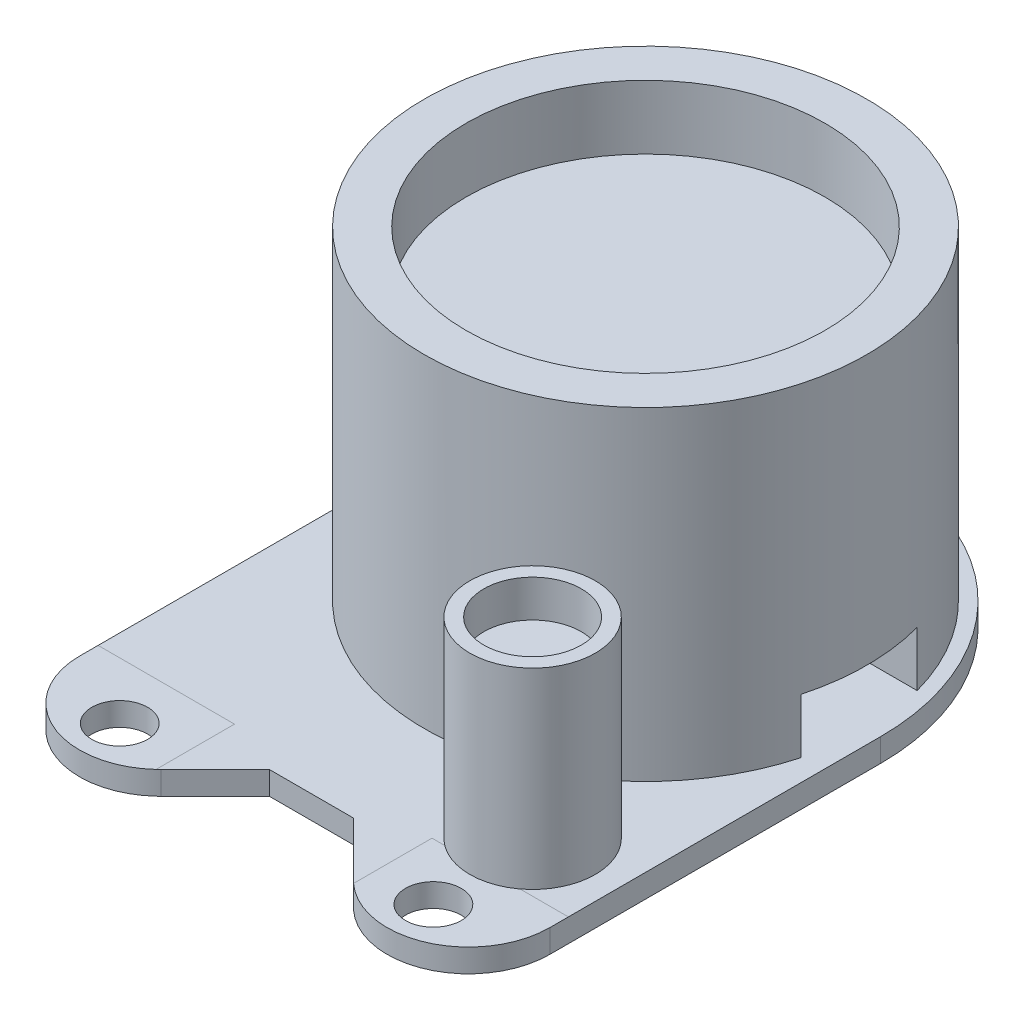
ISO-10303-21;
HEADER;
FILE_DESCRIPTION(('STEP AP214'),'2;1');
FILE_NAME('part.step','',(''),(''),'','','');
FILE_SCHEMA(('AUTOMOTIVE_DESIGN { 1 0 10303 214 1 1 1 1 }'));
ENDSEC;
DATA;
#1=APPLICATION_CONTEXT('core data for automotive mechanical design processes');
#2=APPLICATION_PROTOCOL_DEFINITION('international standard','automotive_design',2000,#1);
#3=PRODUCT_CONTEXT('',#1,'mechanical');
#4=PRODUCT('Part','Part','',(#3));
#5=PRODUCT_RELATED_PRODUCT_CATEGORY('part','',(#4));
#6=PRODUCT_DEFINITION_FORMATION('','',#4);
#7=PRODUCT_DEFINITION_CONTEXT('part definition',#1,'design');
#8=PRODUCT_DEFINITION('design','',#6,#7);
#9=PRODUCT_DEFINITION_SHAPE('','',#8);
#10=(LENGTH_UNIT() NAMED_UNIT(*) SI_UNIT(.MILLI.,.METRE.));
#11=(NAMED_UNIT(*) PLANE_ANGLE_UNIT() SI_UNIT($,.RADIAN.));
#12=(NAMED_UNIT(*) SI_UNIT($,.STERADIAN.) SOLID_ANGLE_UNIT());
#13=UNCERTAINTY_MEASURE_WITH_UNIT(LENGTH_MEASURE(1.E-05),#10,'distance_accuracy_value','');
#14=(GEOMETRIC_REPRESENTATION_CONTEXT(3) GLOBAL_UNCERTAINTY_ASSIGNED_CONTEXT((#13)) GLOBAL_UNIT_ASSIGNED_CONTEXT((#10,
#11,#12)) REPRESENTATION_CONTEXT('',''));
#15=CARTESIAN_POINT('',(0.,0.,0.));
#16=DIRECTION('',(0.,0.,1.));
#17=DIRECTION('',(1.,0.,0.));
#18=AXIS2_PLACEMENT_3D('',#15,#16,#17);
#19=CARTESIAN_POINT('',(6.42,9.25,11.28));
#20=DIRECTION('',(0.,1.,0.));
#21=DIRECTION('',(0.,0.,1.));
#22=AXIS2_PLACEMENT_3D('',#19,#20,#21);
#23=PLANE('',#22);
#24=CARTESIAN_POINT('',(6.42,9.25,11.28));
#25=DIRECTION('',(0.,1.,0.));
#26=DIRECTION('',(0.,0.,1.));
#27=AXIS2_PLACEMENT_3D('',#24,#25,#26);
#28=CIRCLE('',#27,2.7);
#29=CARTESIAN_POINT('',(6.42,9.25,13.98));
#30=VERTEX_POINT('',#29);
#31=EDGE_CURVE('E58',#30,#30,#28,.T.);
#32=ORIENTED_EDGE('',*,*,#31,.T.);
#33=EDGE_LOOP('',(#32));
#34=FACE_BOUND('',#33,.T.);
#35=CARTESIAN_POINT('',(6.42,9.25,11.28));
#36=DIRECTION('',(0.,1.,0.));
#37=DIRECTION('',(1.,0.,0.));
#38=AXIS2_PLACEMENT_3D('',#35,#36,#37);
#39=CIRCLE('',#38,2.1);
#40=CARTESIAN_POINT('',(8.52,9.25,11.28));
#41=VERTEX_POINT('',#40);
#42=EDGE_CURVE('E67',#41,#41,#39,.T.);
#43=ORIENTED_EDGE('',*,*,#42,.F.);
#44=EDGE_LOOP('',(#43));
#45=FACE_BOUND('',#44,.T.);
#46=ADVANCED_FACE('F51',(#34,#45),#23,.T.);
#47=CARTESIAN_POINT('',(6.42,1.,11.28));
#48=DIRECTION('',(0.,1.,0.));
#49=DIRECTION('',(0.,0.,1.));
#50=AXIS2_PLACEMENT_3D('',#47,#48,#49);
#51=PLANE('',#50);
#52=CARTESIAN_POINT('',(6.42,1.,11.28));
#53=DIRECTION('',(0.,1.,0.));
#54=DIRECTION('',(0.,0.,1.));
#55=AXIS2_PLACEMENT_3D('',#52,#53,#54);
#56=CIRCLE('',#55,2.7);
#57=CARTESIAN_POINT('',(6.42,1.,13.98));
#58=VERTEX_POINT('',#57);
#59=EDGE_CURVE('E62',#58,#58,#56,.T.);
#60=ORIENTED_EDGE('',*,*,#59,.F.);
#61=EDGE_LOOP('',(#60));
#62=FACE_BOUND('',#61,.T.);
#63=ADVANCED_FACE('F75',(#62),#51,.F.);
#64=CARTESIAN_POINT('',(6.42,9.25,11.28));
#65=DIRECTION('',(0.,-1.,0.));
#66=DIRECTION('',(0.,0.,-1.));
#67=AXIS2_PLACEMENT_3D('',#64,#65,#66);
#68=CYLINDRICAL_SURFACE('',#67,2.7);
#69=ORIENTED_EDGE('',*,*,#31,.F.);
#70=EDGE_LOOP('',(#69));
#71=FACE_BOUND('',#70,.T.);
#72=ORIENTED_EDGE('',*,*,#59,.T.);
#73=EDGE_LOOP('',(#72));
#74=FACE_BOUND('',#73,.T.);
#75=ADVANCED_FACE('F53',(#71,#74),#68,.T.);
#76=CARTESIAN_POINT('',(6.42,9.25,11.28));
#77=DIRECTION('',(0.,-1.,0.));
#78=DIRECTION('',(0.,0.,-1.));
#79=AXIS2_PLACEMENT_3D('',#76,#77,#78);
#80=CYLINDRICAL_SURFACE('',#79,2.1);
#81=CARTESIAN_POINT('',(6.42,7.65,11.28));
#82=DIRECTION('',(0.,1.,0.));
#83=DIRECTION('',(0.,0.,1.));
#84=AXIS2_PLACEMENT_3D('',#81,#82,#83);
#85=CIRCLE('',#84,2.1);
#86=CARTESIAN_POINT('',(6.42,7.65,13.38));
#87=VERTEX_POINT('',#86);
#88=EDGE_CURVE('E12',#87,#87,#85,.T.);
#89=ORIENTED_EDGE('',*,*,#88,.F.);
#90=EDGE_LOOP('',(#89));
#91=FACE_BOUND('',#90,.T.);
#92=ORIENTED_EDGE('',*,*,#42,.T.);
#93=EDGE_LOOP('',(#92));
#94=FACE_BOUND('',#93,.T.);
#95=ADVANCED_FACE('F72',(#91,#94),#80,.F.);
#96=CARTESIAN_POINT('',(6.42,7.65,11.28));
#97=DIRECTION('',(0.,1.,0.));
#98=DIRECTION('',(0.,0.,1.));
#99=AXIS2_PLACEMENT_3D('',#96,#97,#98);
#100=PLANE('',#99);
#101=ORIENTED_EDGE('',*,*,#88,.T.);
#102=EDGE_LOOP('',(#101));
#103=FACE_BOUND('',#102,.T.);
#104=ADVANCED_FACE('F84',(#103),#100,.T.);
#105=CLOSED_SHELL('',(#46,#63,#75,#95,#104));
#106=MANIFOLD_SOLID_BREP('B2',#105);
#107=CARTESIAN_POINT('',(0.,-18.4895995386643,0.));
#108=DIRECTION('',(0.,1.,0.));
#109=DIRECTION('',(0.,0.,1.));
#110=AXIS2_PLACEMENT_3D('',#107,#108,#109);
#111=CYLINDRICAL_SURFACE('',#110,7.725);
#112=CARTESIAN_POINT('',(0.,3.36,0.));
#113=DIRECTION('',(0.,1.,0.));
#114=DIRECTION('',(0.,0.,1.));
#115=AXIS2_PLACEMENT_3D('',#112,#113,#114);
#116=CIRCLE('',#115,7.725);
#117=CARTESIAN_POINT('',(0.,3.36,7.725));
#118=VERTEX_POINT('',#117);
#119=EDGE_CURVE('E141',#118,#118,#116,.F.);
#120=ORIENTED_EDGE('',*,*,#119,.F.);
#121=EDGE_LOOP('',(#120));
#122=FACE_BOUND('',#121,.T.);
#123=CARTESIAN_POINT('',(0.,12.19,0.));
#124=DIRECTION('',(0.,1.,0.));
#125=DIRECTION('',(0.,0.,1.));
#126=AXIS2_PLACEMENT_3D('',#123,#124,#125);
#127=CIRCLE('',#126,7.725);
#128=CARTESIAN_POINT('',(0.,12.19,7.725));
#129=VERTEX_POINT('',#128);
#130=EDGE_CURVE('E145',#129,#129,#127,.T.);
#131=ORIENTED_EDGE('',*,*,#130,.F.);
#132=EDGE_LOOP('',(#131));
#133=FACE_BOUND('',#132,.T.);
#134=ADVANCED_FACE('F134',(#122,#133),#111,.T.);
#135=CARTESIAN_POINT('',(0.,12.19,0.));
#136=DIRECTION('',(0.,1.,0.));
#137=DIRECTION('',(0.,0.,1.));
#138=AXIS2_PLACEMENT_3D('',#135,#136,#137);
#139=PLANE('',#138);
#140=ORIENTED_EDGE('',*,*,#130,.T.);
#141=EDGE_LOOP('',(#140));
#142=FACE_BOUND('',#141,.T.);
#143=ADVANCED_FACE('F165',(#142),#139,.T.);
#144=CARTESIAN_POINT('',(-10.12,3.36,2.5));
#145=DIRECTION('',(0.,1.,0.));
#146=DIRECTION('',(0.,0.,1.));
#147=AXIS2_PLACEMENT_3D('',#144,#145,#146);
#148=PLANE('',#147);
#149=CARTESIAN_POINT('',(0.,3.36,0.));
#150=DIRECTION('',(0.,1.,0.));
#151=DIRECTION('',(0.,0.,1.));
#152=AXIS2_PLACEMENT_3D('',#149,#150,#151);
#153=CIRCLE('',#152,4.);
#154=CARTESIAN_POINT('',(0.,3.36,4.));
#155=VERTEX_POINT('',#154);
#156=EDGE_CURVE('E150',#155,#155,#153,.T.);
#157=ORIENTED_EDGE('',*,*,#156,.T.);
#158=EDGE_LOOP('',(#157));
#159=FACE_BOUND('',#158,.T.);
#160=ORIENTED_EDGE('',*,*,#119,.T.);
#161=EDGE_LOOP('',(#160));
#162=FACE_BOUND('',#161,.T.);
#163=ADVANCED_FACE('F155',(#159,#162),#148,.F.);
#164=CARTESIAN_POINT('',(0.,7.45,0.));
#165=DIRECTION('',(0.,-1.,0.));
#166=DIRECTION('',(0.,0.,-1.));
#167=AXIS2_PLACEMENT_3D('',#164,#165,#166);
#168=CYLINDRICAL_SURFACE('',#167,4.);
#169=CARTESIAN_POINT('',(0.,3.45,0.));
#170=DIRECTION('',(0.,-1.,0.));
#171=DIRECTION('',(0.,0.,-1.));
#172=AXIS2_PLACEMENT_3D('',#169,#170,#171);
#173=CIRCLE('',#172,4.);
#174=CARTESIAN_POINT('',(0.,3.45,-4.));
#175=VERTEX_POINT('',#174);
#176=EDGE_CURVE('E50',#175,#175,#173,.F.);
#177=ORIENTED_EDGE('',*,*,#176,.T.);
#178=EDGE_LOOP('',(#177));
#179=FACE_BOUND('',#178,.T.);
#180=ORIENTED_EDGE('',*,*,#156,.F.);
#181=EDGE_LOOP('',(#180));
#182=FACE_BOUND('',#181,.T.);
#183=ADVANCED_FACE('F157',(#179,#182),#168,.F.);
#184=CARTESIAN_POINT('',(0.,3.45,0.));
#185=DIRECTION('',(0.,-1.,0.));
#186=DIRECTION('',(0.,0.,-1.));
#187=AXIS2_PLACEMENT_3D('',#184,#185,#186);
#188=SPHERICAL_SURFACE('',#187,4.);
#189=ORIENTED_EDGE('',*,*,#176,.F.);
#190=EDGE_LOOP('',(#189));
#191=FACE_BOUND('',#190,.T.);
#192=ADVANCED_FACE('F136',(#191),#188,.F.);
#193=CLOSED_SHELL('',(#134,#143,#163,#183,#192));
#194=MANIFOLD_SOLID_BREP('B7',#193);
#195=CARTESIAN_POINT('',(0.,1.,0.));
#196=DIRECTION('',(0.,1.,0.));
#197=DIRECTION('',(0.,0.,1.));
#198=AXIS2_PLACEMENT_3D('',#195,#196,#197);
#199=PLANE('',#198);
#200=CARTESIAN_POINT('',(0.,1.,0.));
#201=DIRECTION('',(0.,1.,0.));
#202=DIRECTION('',(0.,0.,1.));
#203=AXIS2_PLACEMENT_3D('',#200,#201,#202);
#204=CIRCLE('',#203,9.525);
#205=CARTESIAN_POINT('',(-9.19106223458421,1.,2.5));
#206=VERTEX_POINT('',#205);
#207=CARTESIAN_POINT('',(9.19106223458421,1.,2.5));
#208=VERTEX_POINT('',#207);
#209=EDGE_CURVE('E298',#206,#208,#204,.T.);
#210=ORIENTED_EDGE('',*,*,#209,.F.);
#211=DIRECTION('',(1.,0.,0.));
#212=VECTOR('',#211,1.);
#213=CARTESIAN_POINT('',(-10.12,1.,2.5));
#214=LINE('',#213,#212);
#215=CARTESIAN_POINT('',(-3.1224989991992,1.,2.5));
#216=VERTEX_POINT('',#215);
#217=EDGE_CURVE('E292',#206,#216,#214,.T.);
#218=ORIENTED_EDGE('',*,*,#217,.T.);
#219=CARTESIAN_POINT('',(0.,1.,0.));
#220=DIRECTION('',(0.,1.,0.));
#221=DIRECTION('',(0.,0.,-1.));
#222=AXIS2_PLACEMENT_3D('',#219,#220,#221);
#223=CIRCLE('',#222,4.);
#224=CARTESIAN_POINT('',(3.1224989991992,1.,2.5));
#225=VERTEX_POINT('',#224);
#226=EDGE_CURVE('E296',#216,#225,#223,.T.);
#227=ORIENTED_EDGE('',*,*,#226,.T.);
#228=EDGE_CURVE('E302',#225,#208,#214,.T.);
#229=ORIENTED_EDGE('',*,*,#228,.T.);
#230=EDGE_LOOP('',(#210,#218,#227,#229));
#231=FACE_BOUND('',#230,.T.);
#232=ADVANCED_FACE('F213',(#231),#199,.F.);
#233=CARTESIAN_POINT('',(0.,14.94,0.));
#234=DIRECTION('',(0.,1.,0.));
#235=DIRECTION('',(0.,0.,1.));
#236=AXIS2_PLACEMENT_3D('',#233,#234,#235);
#237=PLANE('',#236);
#238=CARTESIAN_POINT('',(0.,14.94,0.));
#239=DIRECTION('',(0.,1.,0.));
#240=DIRECTION('',(0.,0.,1.));
#241=AXIS2_PLACEMENT_3D('',#238,#239,#240);
#242=CIRCLE('',#241,9.525);
#243=CARTESIAN_POINT('',(0.,14.94,9.525));
#244=VERTEX_POINT('',#243);
#245=EDGE_CURVE('E372',#244,#244,#242,.T.);
#246=ORIENTED_EDGE('',*,*,#245,.T.);
#247=EDGE_LOOP('',(#246));
#248=FACE_BOUND('',#247,.T.);
#249=CARTESIAN_POINT('',(0.,14.94,0.));
#250=DIRECTION('',(0.,1.,0.));
#251=DIRECTION('',(0.,0.,1.));
#252=AXIS2_PLACEMENT_3D('',#249,#250,#251);
#253=CIRCLE('',#252,7.725);
#254=CARTESIAN_POINT('',(0.,14.94,7.725));
#255=VERTEX_POINT('',#254);
#256=EDGE_CURVE('E369',#255,#255,#253,.T.);
#257=ORIENTED_EDGE('',*,*,#256,.F.);
#258=EDGE_LOOP('',(#257));
#259=FACE_BOUND('',#258,.T.);
#260=ADVANCED_FACE('F417',(#248,#259),#237,.T.);
#261=CARTESIAN_POINT('',(9.19106223458421,1.,-2.5));
#262=VERTEX_POINT('',#261);
#263=CARTESIAN_POINT('',(-9.19106223458421,1.,-2.5));
#264=VERTEX_POINT('',#263);
#265=EDGE_CURVE('E374',#262,#264,#204,.T.);
#266=ORIENTED_EDGE('',*,*,#265,.F.);
#267=DIRECTION('',(1.,0.,0.));
#268=VECTOR('',#267,1.);
#269=CARTESIAN_POINT('',(-10.12,1.,-2.5));
#270=LINE('',#269,#268);
#271=CARTESIAN_POINT('',(3.1224989991992,1.,-2.5));
#272=VERTEX_POINT('',#271);
#273=EDGE_CURVE('E301',#272,#262,#270,.T.);
#274=ORIENTED_EDGE('',*,*,#273,.F.);
#275=CARTESIAN_POINT('',(0.,1.,0.));
#276=DIRECTION('',(0.,1.,0.));
#277=DIRECTION('',(0.,0.,-1.));
#278=AXIS2_PLACEMENT_3D('',#275,#276,#277);
#279=CIRCLE('',#278,4.);
#280=CARTESIAN_POINT('',(-3.1224989991992,1.,-2.5));
#281=VERTEX_POINT('',#280);
#282=EDGE_CURVE('E326',#272,#281,#279,.T.);
#283=ORIENTED_EDGE('',*,*,#282,.T.);
#284=EDGE_CURVE('E353',#264,#281,#270,.T.);
#285=ORIENTED_EDGE('',*,*,#284,.F.);
#286=EDGE_LOOP('',(#266,#274,#283,#285));
#287=FACE_BOUND('',#286,.T.);
#288=ADVANCED_FACE('F380',(#287),#199,.F.);
#289=CARTESIAN_POINT('',(0.,14.94,0.));
#290=DIRECTION('',(0.,-1.,0.));
#291=DIRECTION('',(0.,0.,-1.));
#292=AXIS2_PLACEMENT_3D('',#289,#290,#291);
#293=CYLINDRICAL_SURFACE('',#292,9.525);
#294=ORIENTED_EDGE('',*,*,#245,.F.);
#295=EDGE_LOOP('',(#294));
#296=FACE_BOUND('',#295,.T.);
#297=ORIENTED_EDGE('',*,*,#209,.T.);
#298=DIRECTION('',(0.,-1.,0.));
#299=VECTOR('',#298,1.);
#300=CARTESIAN_POINT('',(9.1910622345842,14.94,2.50000000000001));
#301=LINE('',#300,#299);
#302=CARTESIAN_POINT('',(9.19106223458421,3.36,2.5));
#303=VERTEX_POINT('',#302);
#304=EDGE_CURVE('E364',#208,#303,#301,.F.);
#305=ORIENTED_EDGE('',*,*,#304,.T.);
#306=CARTESIAN_POINT('',(0.,3.36,0.));
#307=DIRECTION('',(0.,1.,0.));
#308=DIRECTION('',(0.,0.,1.));
#309=AXIS2_PLACEMENT_3D('',#306,#307,#308);
#310=CIRCLE('',#309,9.525);
#311=CARTESIAN_POINT('',(9.19106223458421,3.36,-2.5));
#312=VERTEX_POINT('',#311);
#313=EDGE_CURVE('E228',#303,#312,#310,.T.);
#314=ORIENTED_EDGE('',*,*,#313,.T.);
#315=DIRECTION('',(0.,-1.,0.));
#316=VECTOR('',#315,1.);
#317=CARTESIAN_POINT('',(9.1910622345842,14.94,-2.50000000000001));
#318=LINE('',#317,#316);
#319=EDGE_CURVE('E358',#312,#262,#318,.T.);
#320=ORIENTED_EDGE('',*,*,#319,.T.);
#321=ORIENTED_EDGE('',*,*,#265,.T.);
#322=DIRECTION('',(0.,-1.,0.));
#323=VECTOR('',#322,1.);
#324=CARTESIAN_POINT('',(-9.1910622345842,14.94,-2.50000000000001));
#325=LINE('',#324,#323);
#326=CARTESIAN_POINT('',(-9.1910622345842,3.36,-2.5));
#327=VERTEX_POINT('',#326);
#328=EDGE_CURVE('E355',#264,#327,#325,.F.);
#329=ORIENTED_EDGE('',*,*,#328,.T.);
#330=CARTESIAN_POINT('',(-9.19106223458421,3.36,2.5));
#331=VERTEX_POINT('',#330);
#332=EDGE_CURVE('E361',#327,#331,#310,.T.);
#333=ORIENTED_EDGE('',*,*,#332,.T.);
#334=DIRECTION('',(0.,-1.,0.));
#335=VECTOR('',#334,1.);
#336=CARTESIAN_POINT('',(-9.1910622345842,14.94,2.50000000000001));
#337=LINE('',#336,#335);
#338=EDGE_CURVE('E367',#331,#206,#337,.T.);
#339=ORIENTED_EDGE('',*,*,#338,.T.);
#340=EDGE_LOOP('',(#297,#305,#314,#320,#321,#329,#333,#339));
#341=FACE_BOUND('',#340,.T.);
#342=ADVANCED_FACE('F215',(#296,#341),#293,.T.);
#343=CARTESIAN_POINT('',(0.,14.94,0.));
#344=DIRECTION('',(0.,-1.,0.));
#345=DIRECTION('',(0.,0.,-1.));
#346=AXIS2_PLACEMENT_3D('',#343,#344,#345);
#347=CYLINDRICAL_SURFACE('',#346,7.725);
#348=CARTESIAN_POINT('',(0.,3.36,0.));
#349=DIRECTION('',(0.,1.,0.));
#350=DIRECTION('',(0.,0.,1.));
#351=AXIS2_PLACEMENT_3D('',#348,#349,#350);
#352=CIRCLE('',#351,7.725);
#353=CARTESIAN_POINT('',(7.30928348061559,3.36,2.5));
#354=VERTEX_POINT('',#353);
#355=CARTESIAN_POINT('',(-7.3092834806156,3.36,2.5));
#356=VERTEX_POINT('',#355);
#357=EDGE_CURVE('E318',#354,#356,#352,.F.);
#358=ORIENTED_EDGE('',*,*,#357,.T.);
#359=CARTESIAN_POINT('',(0.,3.36,0.));
#360=DIRECTION('',(0.,1.,0.));
#361=DIRECTION('',(0.,0.,1.));
#362=AXIS2_PLACEMENT_3D('',#359,#360,#361);
#363=CIRCLE('',#362,7.725);
#364=CARTESIAN_POINT('',(-7.3092834806156,3.36,-2.5));
#365=VERTEX_POINT('',#364);
#366=EDGE_CURVE('E217',#365,#356,#363,.T.);
#367=ORIENTED_EDGE('',*,*,#366,.F.);
#368=CARTESIAN_POINT('',(0.,3.36,0.));
#369=DIRECTION('',(0.,1.,0.));
#370=DIRECTION('',(0.,0.,1.));
#371=AXIS2_PLACEMENT_3D('',#368,#369,#370);
#372=CIRCLE('',#371,7.725);
#373=CARTESIAN_POINT('',(7.30928348061559,3.36,-2.5));
#374=VERTEX_POINT('',#373);
#375=EDGE_CURVE('E333',#365,#374,#372,.F.);
#376=ORIENTED_EDGE('',*,*,#375,.T.);
#377=EDGE_CURVE('E132',#354,#374,#363,.T.);
#378=ORIENTED_EDGE('',*,*,#377,.F.);
#379=EDGE_LOOP('',(#358,#367,#376,#378));
#380=FACE_BOUND('',#379,.T.);
#381=ORIENTED_EDGE('',*,*,#256,.T.);
#382=EDGE_LOOP('',(#381));
#383=FACE_BOUND('',#382,.T.);
#384=ADVANCED_FACE('F398',(#380,#383),#347,.F.);
#385=CARTESIAN_POINT('',(-10.12,1.,-2.5));
#386=DIRECTION('',(0.,0.,-1.));
#387=DIRECTION('',(0.,1.,0.));
#388=AXIS2_PLACEMENT_3D('',#385,#386,#387);
#389=PLANE('',#388);
#390=ORIENTED_EDGE('',*,*,#284,.T.);
#391=DIRECTION('',(0.,-1.,0.));
#392=VECTOR('',#391,1.);
#393=CARTESIAN_POINT('',(-3.1224989991992,18.8842753454066,-2.5));
#394=LINE('',#393,#392);
#395=CARTESIAN_POINT('',(-3.1224989991992,3.36,-2.5));
#396=VERTEX_POINT('',#395);
#397=EDGE_CURVE('E339',#396,#281,#394,.T.);
#398=ORIENTED_EDGE('',*,*,#397,.F.);
#399=DIRECTION('',(-1.,0.,0.));
#400=VECTOR('',#399,1.);
#401=CARTESIAN_POINT('',(-7.3092834806156,3.36,-2.5));
#402=LINE('',#401,#400);
#403=EDGE_CURVE('E336',#396,#365,#402,.T.);
#404=ORIENTED_EDGE('',*,*,#403,.T.);
#405=DIRECTION('',(1.,0.,0.));
#406=VECTOR('',#405,1.);
#407=CARTESIAN_POINT('',(-10.12,3.36,-2.5));
#408=LINE('',#407,#406);
#409=EDGE_CURVE('E350',#327,#365,#408,.T.);
#410=ORIENTED_EDGE('',*,*,#409,.F.);
#411=ORIENTED_EDGE('',*,*,#328,.F.);
#412=EDGE_LOOP('',(#390,#398,#404,#410,#411));
#413=FACE_BOUND('',#412,.T.);
#414=ADVANCED_FACE('F384',(#413),#389,.F.);
#415=CARTESIAN_POINT('',(-10.12,3.36,2.5));
#416=DIRECTION('',(0.,1.,0.));
#417=DIRECTION('',(0.,0.,1.));
#418=AXIS2_PLACEMENT_3D('',#415,#416,#417);
#419=PLANE('',#418);
#420=ORIENTED_EDGE('',*,*,#409,.T.);
#421=ORIENTED_EDGE('',*,*,#366,.T.);
#422=DIRECTION('',(1.,0.,0.));
#423=VECTOR('',#422,1.);
#424=CARTESIAN_POINT('',(-10.12,3.36,2.5));
#425=LINE('',#424,#423);
#426=EDGE_CURVE('E349',#331,#356,#425,.T.);
#427=ORIENTED_EDGE('',*,*,#426,.F.);
#428=ORIENTED_EDGE('',*,*,#332,.F.);
#429=EDGE_LOOP('',(#420,#421,#427,#428));
#430=FACE_BOUND('',#429,.T.);
#431=ADVANCED_FACE('F395',(#430),#419,.F.);
#432=CARTESIAN_POINT('',(-10.12,1.,2.5));
#433=DIRECTION('',(0.,0.,1.));
#434=DIRECTION('',(0.,-1.,0.));
#435=AXIS2_PLACEMENT_3D('',#432,#433,#434);
#436=PLANE('',#435);
#437=ORIENTED_EDGE('',*,*,#426,.T.);
#438=DIRECTION('',(1.,0.,0.));
#439=VECTOR('',#438,1.);
#440=CARTESIAN_POINT('',(-7.3092834806156,3.36,2.5));
#441=LINE('',#440,#439);
#442=CARTESIAN_POINT('',(-3.1224989991992,3.36,2.5));
#443=VERTEX_POINT('',#442);
#444=EDGE_CURVE('E309',#356,#443,#441,.T.);
#445=ORIENTED_EDGE('',*,*,#444,.T.);
#446=DIRECTION('',(0.,-1.,0.));
#447=VECTOR('',#446,1.);
#448=CARTESIAN_POINT('',(-3.1224989991992,18.8842753454066,2.5));
#449=LINE('',#448,#447);
#450=EDGE_CURVE('E306',#443,#216,#449,.T.);
#451=ORIENTED_EDGE('',*,*,#450,.T.);
#452=ORIENTED_EDGE('',*,*,#217,.F.);
#453=ORIENTED_EDGE('',*,*,#338,.F.);
#454=EDGE_LOOP('',(#437,#445,#451,#452,#453));
#455=FACE_BOUND('',#454,.T.);
#456=ADVANCED_FACE('F308',(#455),#436,.F.);
#457=ORIENTED_EDGE('',*,*,#228,.F.);
#458=DIRECTION('',(0.,-1.,0.));
#459=VECTOR('',#458,1.);
#460=CARTESIAN_POINT('',(3.1224989991992,18.8842753454066,2.5));
#461=LINE('',#460,#459);
#462=CARTESIAN_POINT('',(3.1224989991992,3.36,2.5));
#463=VERTEX_POINT('',#462);
#464=EDGE_CURVE('E316',#463,#225,#461,.T.);
#465=ORIENTED_EDGE('',*,*,#464,.F.);
#466=DIRECTION('',(1.,0.,0.));
#467=VECTOR('',#466,1.);
#468=CARTESIAN_POINT('',(3.1224989991992,3.36,2.5));
#469=LINE('',#468,#467);
#470=EDGE_CURVE('E235',#463,#354,#469,.T.);
#471=ORIENTED_EDGE('',*,*,#470,.T.);
#472=EDGE_CURVE('E347',#354,#303,#425,.T.);
#473=ORIENTED_EDGE('',*,*,#472,.T.);
#474=ORIENTED_EDGE('',*,*,#304,.F.);
#475=EDGE_LOOP('',(#457,#465,#471,#473,#474));
#476=FACE_BOUND('',#475,.T.);
#477=ADVANCED_FACE('F405',(#476),#436,.F.);
#478=ORIENTED_EDGE('',*,*,#472,.F.);
#479=ORIENTED_EDGE('',*,*,#377,.T.);
#480=EDGE_CURVE('E351',#374,#312,#408,.T.);
#481=ORIENTED_EDGE('',*,*,#480,.T.);
#482=ORIENTED_EDGE('',*,*,#313,.F.);
#483=EDGE_LOOP('',(#478,#479,#481,#482));
#484=FACE_BOUND('',#483,.T.);
#485=ADVANCED_FACE('F404',(#484),#419,.F.);
#486=ORIENTED_EDGE('',*,*,#480,.F.);
#487=DIRECTION('',(-1.,0.,0.));
#488=VECTOR('',#487,1.);
#489=CARTESIAN_POINT('',(3.1224989991992,3.36,-2.5));
#490=LINE('',#489,#488);
#491=CARTESIAN_POINT('',(3.1224989991992,3.36,-2.5));
#492=VERTEX_POINT('',#491);
#493=EDGE_CURVE('E329',#374,#492,#490,.T.);
#494=ORIENTED_EDGE('',*,*,#493,.T.);
#495=DIRECTION('',(0.,-1.,0.));
#496=VECTOR('',#495,1.);
#497=CARTESIAN_POINT('',(3.1224989991992,18.8842753454066,-2.5));
#498=LINE('',#497,#496);
#499=EDGE_CURVE('E332',#492,#272,#498,.T.);
#500=ORIENTED_EDGE('',*,*,#499,.T.);
#501=ORIENTED_EDGE('',*,*,#273,.T.);
#502=ORIENTED_EDGE('',*,*,#319,.F.);
#503=EDGE_LOOP('',(#486,#494,#500,#501,#502));
#504=FACE_BOUND('',#503,.T.);
#505=ADVANCED_FACE('F412',(#504),#389,.F.);
#506=CARTESIAN_POINT('',(-10.12,3.36,2.5));
#507=DIRECTION('',(0.,1.,0.));
#508=DIRECTION('',(0.,0.,1.));
#509=AXIS2_PLACEMENT_3D('',#506,#507,#508);
#510=PLANE('',#509);
#511=ORIENTED_EDGE('',*,*,#375,.F.);
#512=ORIENTED_EDGE('',*,*,#403,.F.);
#513=CARTESIAN_POINT('',(0.,3.36,0.));
#514=DIRECTION('',(0.,1.,0.));
#515=DIRECTION('',(0.,0.,1.));
#516=AXIS2_PLACEMENT_3D('',#513,#514,#515);
#517=CIRCLE('',#516,4.);
#518=EDGE_CURVE('E340',#492,#396,#517,.T.);
#519=ORIENTED_EDGE('',*,*,#518,.F.);
#520=ORIENTED_EDGE('',*,*,#493,.F.);
#521=EDGE_LOOP('',(#511,#512,#519,#520));
#522=FACE_BOUND('',#521,.T.);
#523=ADVANCED_FACE('F390',(#522),#510,.T.);
#524=CARTESIAN_POINT('',(0.,18.8842753454066,0.));
#525=DIRECTION('',(0.,-1.,0.));
#526=DIRECTION('',(0.,0.,-1.));
#527=AXIS2_PLACEMENT_3D('',#524,#525,#526);
#528=CYLINDRICAL_SURFACE('',#527,4.);
#529=ORIENTED_EDGE('',*,*,#499,.F.);
#530=ORIENTED_EDGE('',*,*,#518,.T.);
#531=ORIENTED_EDGE('',*,*,#397,.T.);
#532=ORIENTED_EDGE('',*,*,#282,.F.);
#533=EDGE_LOOP('',(#529,#530,#531,#532));
#534=FACE_BOUND('',#533,.T.);
#535=ADVANCED_FACE('F388',(#534),#528,.F.);
#536=CARTESIAN_POINT('',(-10.12,3.36,2.5));
#537=DIRECTION('',(0.,1.,0.));
#538=DIRECTION('',(0.,0.,1.));
#539=AXIS2_PLACEMENT_3D('',#536,#537,#538);
#540=PLANE('',#539);
#541=CARTESIAN_POINT('',(0.,3.36,0.));
#542=DIRECTION('',(0.,1.,0.));
#543=DIRECTION('',(0.,0.,1.));
#544=AXIS2_PLACEMENT_3D('',#541,#542,#543);
#545=CIRCLE('',#544,4.);
#546=EDGE_CURVE('E312',#443,#463,#545,.T.);
#547=ORIENTED_EDGE('',*,*,#546,.F.);
#548=ORIENTED_EDGE('',*,*,#444,.F.);
#549=ORIENTED_EDGE('',*,*,#357,.F.);
#550=ORIENTED_EDGE('',*,*,#470,.F.);
#551=EDGE_LOOP('',(#547,#548,#549,#550));
#552=FACE_BOUND('',#551,.T.);
#553=ADVANCED_FACE('F403',(#552),#540,.T.);
#554=CARTESIAN_POINT('',(0.,18.8842753454066,0.));
#555=DIRECTION('',(0.,-1.,0.));
#556=DIRECTION('',(0.,0.,-1.));
#557=AXIS2_PLACEMENT_3D('',#554,#555,#556);
#558=CYLINDRICAL_SURFACE('',#557,4.);
#559=ORIENTED_EDGE('',*,*,#450,.F.);
#560=ORIENTED_EDGE('',*,*,#546,.T.);
#561=ORIENTED_EDGE('',*,*,#464,.T.);
#562=ORIENTED_EDGE('',*,*,#226,.F.);
#563=EDGE_LOOP('',(#559,#560,#561,#562));
#564=FACE_BOUND('',#563,.T.);
#565=ADVANCED_FACE('F315',(#564),#558,.F.);
#566=CLOSED_SHELL('',(#232,#260,#288,#342,#384,#414,#431,#456,#477,#485,#505,#523,#535,#553,#565));
#567=MANIFOLD_SOLID_BREP('B45',#566);
#568=CARTESIAN_POINT('',(0.,0.,0.));
#569=DIRECTION('',(0.,1.,0.));
#570=DIRECTION('',(0.,0.,1.));
#571=AXIS2_PLACEMENT_3D('',#568,#569,#570);
#572=PLANE('',#571);
#573=CARTESIAN_POINT('',(0.,0.,0.));
#574=DIRECTION('',(0.,1.,0.));
#575=DIRECTION('',(0.,0.,1.));
#576=AXIS2_PLACEMENT_3D('',#573,#574,#575);
#577=CIRCLE('',#576,4.25);
#578=CARTESIAN_POINT('',(0.,0.,4.25));
#579=VERTEX_POINT('',#578);
#580=EDGE_CURVE('E703',#579,#579,#577,.F.);
#581=ORIENTED_EDGE('',*,*,#580,.T.);
#582=EDGE_LOOP('',(#581));
#583=FACE_BOUND('',#582,.T.);
#584=CARTESIAN_POINT('',(3.75,0.,0.));
#585=DIRECTION('',(0.,1.,0.));
#586=DIRECTION('',(0.,0.,1.));
#587=AXIS2_PLACEMENT_3D('',#584,#585,#586);
#588=CIRCLE('',#587,0.15);
#589=CARTESIAN_POINT('',(3.75,0.,0.15));
#590=VERTEX_POINT('',#589);
#591=EDGE_CURVE('E709',#590,#590,#588,.F.);
#592=ORIENTED_EDGE('',*,*,#591,.F.);
#593=EDGE_LOOP('',(#592));
#594=FACE_BOUND('',#593,.T.);
#595=CARTESIAN_POINT('',(2.65165042944955,0.,-2.65165042944955));
#596=DIRECTION('',(0.,1.,0.));
#597=DIRECTION('',(0.,0.,1.));
#598=AXIS2_PLACEMENT_3D('',#595,#596,#597);
#599=CIRCLE('',#598,0.15);
#600=CARTESIAN_POINT('',(2.65165042944955,0.,-2.50165042944955));
#601=VERTEX_POINT('',#600);
#602=EDGE_CURVE('E713',#601,#601,#599,.F.);
#603=ORIENTED_EDGE('',*,*,#602,.F.);
#604=EDGE_LOOP('',(#603));
#605=FACE_BOUND('',#604,.T.);
#606=CARTESIAN_POINT('',(0.,0.,-3.75));
#607=DIRECTION('',(0.,1.,0.));
#608=DIRECTION('',(0.,0.,1.));
#609=AXIS2_PLACEMENT_3D('',#606,#607,#608);
#610=CIRCLE('',#609,0.15);
#611=CARTESIAN_POINT('',(0.,0.,-3.6));
#612=VERTEX_POINT('',#611);
#613=EDGE_CURVE('E717',#612,#612,#610,.F.);
#614=ORIENTED_EDGE('',*,*,#613,.F.);
#615=EDGE_LOOP('',(#614));
#616=FACE_BOUND('',#615,.T.);
#617=CARTESIAN_POINT('',(-2.65165042944956,0.,-2.65165042944954));
#618=DIRECTION('',(0.,1.,0.));
#619=DIRECTION('',(0.,0.,1.));
#620=AXIS2_PLACEMENT_3D('',#617,#618,#619);
#621=CIRCLE('',#620,0.15);
#622=CARTESIAN_POINT('',(-2.65165042944956,0.,-2.50165042944954));
#623=VERTEX_POINT('',#622);
#624=EDGE_CURVE('E721',#623,#623,#621,.F.);
#625=ORIENTED_EDGE('',*,*,#624,.F.);
#626=EDGE_LOOP('',(#625));
#627=FACE_BOUND('',#626,.T.);
#628=CARTESIAN_POINT('',(-3.75,0.,0.));
#629=DIRECTION('',(0.,1.,0.));
#630=DIRECTION('',(0.,0.,1.));
#631=AXIS2_PLACEMENT_3D('',#628,#629,#630);
#632=CIRCLE('',#631,0.15);
#633=CARTESIAN_POINT('',(-3.75,0.,0.150000000000021));
#634=VERTEX_POINT('',#633);
#635=EDGE_CURVE('E725',#634,#634,#632,.F.);
#636=ORIENTED_EDGE('',*,*,#635,.F.);
#637=EDGE_LOOP('',(#636));
#638=FACE_BOUND('',#637,.T.);
#639=CARTESIAN_POINT('',(-2.65165042944953,0.,2.65165042944957));
#640=DIRECTION('',(0.,1.,0.));
#641=DIRECTION('',(0.,0.,1.));
#642=AXIS2_PLACEMENT_3D('',#639,#640,#641);
#643=CIRCLE('',#642,0.15);
#644=CARTESIAN_POINT('',(-2.65165042944953,0.,2.80165042944957));
#645=VERTEX_POINT('',#644);
#646=EDGE_CURVE('E729',#645,#645,#643,.F.);
#647=ORIENTED_EDGE('',*,*,#646,.F.);
#648=EDGE_LOOP('',(#647));
#649=FACE_BOUND('',#648,.T.);
#650=CARTESIAN_POINT('',(0.,0.,3.75));
#651=DIRECTION('',(0.,1.,0.));
#652=DIRECTION('',(0.,0.,1.));
#653=AXIS2_PLACEMENT_3D('',#650,#651,#652);
#654=CIRCLE('',#653,0.15);
#655=CARTESIAN_POINT('',(0.,0.,3.9));
#656=VERTEX_POINT('',#655);
#657=EDGE_CURVE('E557',#656,#656,#654,.F.);
#658=ORIENTED_EDGE('',*,*,#657,.F.);
#659=EDGE_LOOP('',(#658));
#660=FACE_BOUND('',#659,.T.);
#661=CARTESIAN_POINT('',(2.65165042944958,0.,2.65165042944952));
#662=DIRECTION('',(0.,1.,0.));
#663=DIRECTION('',(0.,0.,1.));
#664=AXIS2_PLACEMENT_3D('',#661,#662,#663);
#665=CIRCLE('',#664,0.15);
#666=CARTESIAN_POINT('',(2.65165042944958,0.,2.80165042944952));
#667=VERTEX_POINT('',#666);
#668=EDGE_CURVE('E211',#667,#667,#665,.F.);
#669=ORIENTED_EDGE('',*,*,#668,.F.);
#670=EDGE_LOOP('',(#669));
#671=FACE_BOUND('',#670,.T.);
#672=ADVANCED_FACE('F548',(#583,#594,#605,#616,#627,#638,#649,#660,#671),#572,.F.);
#673=ORIENTED_EDGE('',*,*,#668,.T.);
#674=EDGE_LOOP('',(#673));
#675=FACE_BOUND('',#674,.T.);
#676=ADVANCED_FACE('F744',(#675),#572,.F.);
#677=ORIENTED_EDGE('',*,*,#657,.T.);
#678=EDGE_LOOP('',(#677));
#679=FACE_BOUND('',#678,.T.);
#680=ADVANCED_FACE('F740',(#679),#572,.F.);
#681=ORIENTED_EDGE('',*,*,#646,.T.);
#682=EDGE_LOOP('',(#681));
#683=FACE_BOUND('',#682,.T.);
#684=ADVANCED_FACE('F754',(#683),#572,.F.);
#685=ORIENTED_EDGE('',*,*,#635,.T.);
#686=EDGE_LOOP('',(#685));
#687=FACE_BOUND('',#686,.T.);
#688=ADVANCED_FACE('F858',(#687),#572,.F.);
#689=ORIENTED_EDGE('',*,*,#624,.T.);
#690=EDGE_LOOP('',(#689));
#691=FACE_BOUND('',#690,.T.);
#692=ADVANCED_FACE('F851',(#691),#572,.F.);
#693=ORIENTED_EDGE('',*,*,#613,.T.);
#694=EDGE_LOOP('',(#693));
#695=FACE_BOUND('',#694,.T.);
#696=ADVANCED_FACE('F844',(#695),#572,.F.);
#697=ORIENTED_EDGE('',*,*,#602,.T.);
#698=EDGE_LOOP('',(#697));
#699=FACE_BOUND('',#698,.T.);
#700=ADVANCED_FACE('F838',(#699),#572,.F.);
#701=DIRECTION('',(0.,0.,1.));
#702=VECTOR('',#701,1.);
#703=CARTESIAN_POINT('',(-4.25,0.,0.));
#704=LINE('',#703,#702);
#705=CARTESIAN_POINT('',(-4.25,0.,13.44));
#706=VERTEX_POINT('',#705);
#707=CARTESIAN_POINT('',(-4.25,0.,16.8154805376861));
#708=VERTEX_POINT('',#707);
#709=EDGE_CURVE('E564',#706,#708,#704,.T.);
#710=ORIENTED_EDGE('',*,*,#709,.F.);
#711=DIRECTION('',(1.,0.,0.));
#712=VECTOR('',#711,1.);
#713=CARTESIAN_POINT('',(0.,0.,13.44));
#714=LINE('',#713,#712);
#715=CARTESIAN_POINT('',(-10.12,0.,13.44));
#716=VERTEX_POINT('',#715);
#717=EDGE_CURVE('E568',#716,#706,#714,.T.);
#718=ORIENTED_EDGE('',*,*,#717,.F.);
#719=DIRECTION('',(0.,0.,1.));
#720=VECTOR('',#719,1.);
#721=CARTESIAN_POINT('',(-10.12,0.,0.));
#722=LINE('',#721,#720);
#723=CARTESIAN_POINT('',(-10.12,0.,0.));
#724=VERTEX_POINT('',#723);
#725=EDGE_CURVE('E1012',#724,#716,#722,.T.);
#726=ORIENTED_EDGE('',*,*,#725,.F.);
#727=CARTESIAN_POINT('',(0.,0.,0.));
#728=DIRECTION('',(0.,1.,0.));
#729=DIRECTION('',(0.,0.,1.));
#730=AXIS2_PLACEMENT_3D('',#727,#728,#729);
#731=CIRCLE('',#730,10.12);
#732=CARTESIAN_POINT('',(10.12,0.,0.));
#733=VERTEX_POINT('',#732);
#734=EDGE_CURVE('E673',#733,#724,#731,.T.);
#735=ORIENTED_EDGE('',*,*,#734,.F.);
#736=DIRECTION('',(0.,0.,-1.));
#737=VECTOR('',#736,1.);
#738=CARTESIAN_POINT('',(10.12,0.,0.));
#739=LINE('',#738,#737);
#740=CARTESIAN_POINT('',(10.12,0.,13.44));
#741=VERTEX_POINT('',#740);
#742=EDGE_CURVE('E1028',#741,#733,#739,.T.);
#743=ORIENTED_EDGE('',*,*,#742,.F.);
#744=DIRECTION('',(1.,0.,0.));
#745=VECTOR('',#744,1.);
#746=CARTESIAN_POINT('',(0.,0.,13.44));
#747=LINE('',#746,#745);
#748=CARTESIAN_POINT('',(4.25,0.,13.44));
#749=VERTEX_POINT('',#748);
#750=EDGE_CURVE('E689',#749,#741,#747,.T.);
#751=ORIENTED_EDGE('',*,*,#750,.F.);
#752=DIRECTION('',(0.,0.,-1.));
#753=VECTOR('',#752,1.);
#754=CARTESIAN_POINT('',(4.25,0.,0.));
#755=LINE('',#754,#753);
#756=CARTESIAN_POINT('',(4.25,0.,16.8154805376861));
#757=VERTEX_POINT('',#756);
#758=EDGE_CURVE('E688',#757,#749,#755,.T.);
#759=ORIENTED_EDGE('',*,*,#758,.F.);
#760=CARTESIAN_POINT('',(6.62,0.,14.24));
#761=DIRECTION('',(0.,1.,0.));
#762=DIRECTION('',(0.,0.,1.));
#763=AXIS2_PLACEMENT_3D('',#760,#761,#762);
#764=CIRCLE('',#763,3.5);
#765=CARTESIAN_POINT('',(4.14512626584709,0.,16.7148737341529));
#766=VERTEX_POINT('',#765);
#767=EDGE_CURVE('E1025',#766,#757,#764,.T.);
#768=ORIENTED_EDGE('',*,*,#767,.F.);
#769=DIRECTION('',(0.707106781186549,0.,0.707106781186546));
#770=VECTOR('',#769,1.);
#771=CARTESIAN_POINT('',(1.81025253169416,0.,14.38));
#772=LINE('',#771,#770);
#773=CARTESIAN_POINT('',(1.81025253169416,0.,14.38));
#774=VERTEX_POINT('',#773);
#775=EDGE_CURVE('E1022',#774,#766,#772,.T.);
#776=ORIENTED_EDGE('',*,*,#775,.F.);
#777=DIRECTION('',(1.,0.,0.));
#778=VECTOR('',#777,1.);
#779=CARTESIAN_POINT('',(-1.81025253169415,0.,14.38));
#780=LINE('',#779,#778);
#781=CARTESIAN_POINT('',(-1.81025253169415,0.,14.38));
#782=VERTEX_POINT('',#781);
#783=EDGE_CURVE('E1020',#782,#774,#780,.T.);
#784=ORIENTED_EDGE('',*,*,#783,.F.);
#785=DIRECTION('',(0.70710678118655,0.,-0.707106781186545));
#786=VECTOR('',#785,1.);
#787=CARTESIAN_POINT('',(-4.14512626584709,0.,16.7148737341529));
#788=LINE('',#787,#786);
#789=CARTESIAN_POINT('',(-4.14512626584709,0.,16.7148737341529));
#790=VERTEX_POINT('',#789);
#791=EDGE_CURVE('E1018',#790,#782,#788,.T.);
#792=ORIENTED_EDGE('',*,*,#791,.F.);
#793=CARTESIAN_POINT('',(-6.62,0.,14.24));
#794=DIRECTION('',(0.,1.,0.));
#795=DIRECTION('',(0.,0.,-1.));
#796=AXIS2_PLACEMENT_3D('',#793,#794,#795);
#797=CIRCLE('',#796,3.5);
#798=EDGE_CURVE('E1014',#708,#790,#797,.T.);
#799=ORIENTED_EDGE('',*,*,#798,.F.);
#800=EDGE_LOOP('',(#710,#718,#726,#735,#743,#751,#759,#768,#776,#784,#792,#799));
#801=FACE_BOUND('',#800,.T.);
#802=ORIENTED_EDGE('',*,*,#580,.F.);
#803=EDGE_LOOP('',(#802));
#804=FACE_BOUND('',#803,.T.);
#805=ADVANCED_FACE('F831',(#801,#804),#572,.F.);
#806=ORIENTED_EDGE('',*,*,#591,.T.);
#807=EDGE_LOOP('',(#806));
#808=FACE_BOUND('',#807,.T.);
#809=ADVANCED_FACE('F819',(#808),#572,.F.);
#810=CARTESIAN_POINT('',(0.,1.,0.));
#811=DIRECTION('',(0.,1.,0.));
#812=DIRECTION('',(0.,0.,1.));
#813=AXIS2_PLACEMENT_3D('',#810,#811,#812);
#814=PLANE('',#813);
#815=DIRECTION('',(1.,0.,0.));
#816=VECTOR('',#815,1.);
#817=CARTESIAN_POINT('',(0.,1.,13.44));
#818=LINE('',#817,#816);
#819=CARTESIAN_POINT('',(-10.12,1.,13.44));
#820=VERTEX_POINT('',#819);
#821=CARTESIAN_POINT('',(-4.25,1.,13.44));
#822=VERTEX_POINT('',#821);
#823=EDGE_CURVE('E692',#820,#822,#818,.T.);
#824=ORIENTED_EDGE('',*,*,#823,.T.);
#825=DIRECTION('',(0.,0.,1.));
#826=VECTOR('',#825,1.);
#827=CARTESIAN_POINT('',(-4.25,1.,0.));
#828=LINE('',#827,#826);
#829=CARTESIAN_POINT('',(-4.25,1.,16.8154805376861));
#830=VERTEX_POINT('',#829);
#831=EDGE_CURVE('E698',#822,#830,#828,.T.);
#832=ORIENTED_EDGE('',*,*,#831,.T.);
#833=CARTESIAN_POINT('',(-6.62,1.,14.24));
#834=DIRECTION('',(0.,1.,0.));
#835=DIRECTION('',(0.,0.,-1.));
#836=AXIS2_PLACEMENT_3D('',#833,#834,#835);
#837=CIRCLE('',#836,3.5);
#838=CARTESIAN_POINT('',(-4.14512626584709,1.,16.7148737341529));
#839=VERTEX_POINT('',#838);
#840=EDGE_CURVE('E660',#830,#839,#837,.T.);
#841=ORIENTED_EDGE('',*,*,#840,.T.);
#842=DIRECTION('',(0.70710678118655,0.,-0.707106781186545));
#843=VECTOR('',#842,1.);
#844=CARTESIAN_POINT('',(-4.14512626584709,1.,16.7148737341529));
#845=LINE('',#844,#843);
#846=CARTESIAN_POINT('',(-1.81025253169415,1.,14.38));
#847=VERTEX_POINT('',#846);
#848=EDGE_CURVE('E996',#839,#847,#845,.T.);
#849=ORIENTED_EDGE('',*,*,#848,.T.);
#850=DIRECTION('',(1.,0.,0.));
#851=VECTOR('',#850,1.);
#852=CARTESIAN_POINT('',(-1.81025253169415,1.,14.38));
#853=LINE('',#852,#851);
#854=CARTESIAN_POINT('',(1.81025253169416,1.,14.38));
#855=VERTEX_POINT('',#854);
#856=EDGE_CURVE('E998',#847,#855,#853,.T.);
#857=ORIENTED_EDGE('',*,*,#856,.T.);
#858=DIRECTION('',(0.707106781186549,0.,0.707106781186546));
#859=VECTOR('',#858,1.);
#860=CARTESIAN_POINT('',(1.81025253169416,1.,14.38));
#861=LINE('',#860,#859);
#862=CARTESIAN_POINT('',(4.14512626584709,1.,16.7148737341529));
#863=VERTEX_POINT('',#862);
#864=EDGE_CURVE('E1000',#855,#863,#861,.T.);
#865=ORIENTED_EDGE('',*,*,#864,.T.);
#866=CARTESIAN_POINT('',(6.62,1.,14.24));
#867=DIRECTION('',(0.,1.,0.));
#868=DIRECTION('',(0.,0.,1.));
#869=AXIS2_PLACEMENT_3D('',#866,#867,#868);
#870=CIRCLE('',#869,3.5);
#871=CARTESIAN_POINT('',(4.25,1.,16.8154805376861));
#872=VERTEX_POINT('',#871);
#873=EDGE_CURVE('E1003',#863,#872,#870,.T.);
#874=ORIENTED_EDGE('',*,*,#873,.T.);
#875=DIRECTION('',(0.,0.,-1.));
#876=VECTOR('',#875,1.);
#877=CARTESIAN_POINT('',(4.25,1.,0.));
#878=LINE('',#877,#876);
#879=CARTESIAN_POINT('',(4.25,1.,13.44));
#880=VERTEX_POINT('',#879);
#881=EDGE_CURVE('E674',#872,#880,#878,.T.);
#882=ORIENTED_EDGE('',*,*,#881,.T.);
#883=DIRECTION('',(1.,0.,0.));
#884=VECTOR('',#883,1.);
#885=CARTESIAN_POINT('',(0.,1.,13.44));
#886=LINE('',#885,#884);
#887=CARTESIAN_POINT('',(10.12,1.,13.44));
#888=VERTEX_POINT('',#887);
#889=EDGE_CURVE('E679',#880,#888,#886,.T.);
#890=ORIENTED_EDGE('',*,*,#889,.T.);
#891=DIRECTION('',(0.,0.,-1.));
#892=VECTOR('',#891,1.);
#893=CARTESIAN_POINT('',(10.12,1.,0.));
#894=LINE('',#893,#892);
#895=CARTESIAN_POINT('',(10.12,1.,0.));
#896=VERTEX_POINT('',#895);
#897=EDGE_CURVE('E666',#888,#896,#894,.T.);
#898=ORIENTED_EDGE('',*,*,#897,.T.);
#899=CARTESIAN_POINT('',(0.,1.,0.));
#900=DIRECTION('',(0.,1.,0.));
#901=DIRECTION('',(0.,0.,1.));
#902=AXIS2_PLACEMENT_3D('',#899,#900,#901);
#903=CIRCLE('',#902,10.12);
#904=CARTESIAN_POINT('',(-10.12,1.,0.));
#905=VERTEX_POINT('',#904);
#906=EDGE_CURVE('E663',#896,#905,#903,.T.);
#907=ORIENTED_EDGE('',*,*,#906,.T.);
#908=DIRECTION('',(0.,0.,1.));
#909=VECTOR('',#908,1.);
#910=CARTESIAN_POINT('',(-10.12,1.,0.));
#911=LINE('',#910,#909);
#912=EDGE_CURVE('E649',#905,#820,#911,.T.);
#913=ORIENTED_EDGE('',*,*,#912,.T.);
#914=EDGE_LOOP('',(#824,#832,#841,#849,#857,#865,#874,#882,#890,#898,#907,#913));
#915=FACE_BOUND('',#914,.T.);
#916=ADVANCED_FACE('F664',(#915),#814,.T.);
#917=CARTESIAN_POINT('',(-6.75,0.,15.88));
#918=DIRECTION('',(0.,1.,0.));
#919=DIRECTION('',(0.,0.,1.));
#920=AXIS2_PLACEMENT_3D('',#917,#918,#919);
#921=CIRCLE('',#920,1.2);
#922=CARTESIAN_POINT('',(-6.75,0.,17.08));
#923=VERTEX_POINT('',#922);
#924=EDGE_CURVE('E984',#923,#923,#921,.T.);
#925=ORIENTED_EDGE('',*,*,#924,.T.);
#926=EDGE_LOOP('',(#925));
#927=FACE_BOUND('',#926,.T.);
#928=ORIENTED_EDGE('',*,*,#717,.T.);
#929=ORIENTED_EDGE('',*,*,#709,.T.);
#930=CARTESIAN_POINT('',(-10.12,0.,14.24));
#931=VERTEX_POINT('',#930);
#932=EDGE_CURVE('E1015',#931,#708,#797,.T.);
#933=ORIENTED_EDGE('',*,*,#932,.F.);
#934=EDGE_CURVE('E1011',#716,#931,#722,.T.);
#935=ORIENTED_EDGE('',*,*,#934,.F.);
#936=EDGE_LOOP('',(#928,#929,#933,#935));
#937=FACE_BOUND('',#936,.T.);
#938=ADVANCED_FACE('F760',(#927,#937),#572,.F.);
#939=ORIENTED_EDGE('',*,*,#831,.F.);
#940=ORIENTED_EDGE('',*,*,#823,.F.);
#941=CARTESIAN_POINT('',(-10.12,1.,14.24));
#942=VERTEX_POINT('',#941);
#943=EDGE_CURVE('E657',#820,#942,#911,.T.);
#944=ORIENTED_EDGE('',*,*,#943,.T.);
#945=EDGE_CURVE('E993',#942,#830,#837,.T.);
#946=ORIENTED_EDGE('',*,*,#945,.T.);
#947=EDGE_LOOP('',(#939,#940,#944,#946));
#948=FACE_BOUND('',#947,.T.);
#949=CARTESIAN_POINT('',(-6.75,1.,15.88));
#950=DIRECTION('',(0.,1.,0.));
#951=DIRECTION('',(0.,0.,1.));
#952=AXIS2_PLACEMENT_3D('',#949,#950,#951);
#953=CIRCLE('',#952,1.2);
#954=CARTESIAN_POINT('',(-6.75,1.,17.08));
#955=VERTEX_POINT('',#954);
#956=EDGE_CURVE('E981',#955,#955,#953,.T.);
#957=ORIENTED_EDGE('',*,*,#956,.F.);
#958=EDGE_LOOP('',(#957));
#959=FACE_BOUND('',#958,.T.);
#960=ADVANCED_FACE('F804',(#948,#959),#814,.T.);
#961=ORIENTED_EDGE('',*,*,#889,.F.);
#962=ORIENTED_EDGE('',*,*,#881,.F.);
#963=CARTESIAN_POINT('',(10.12,1.,14.24));
#964=VERTEX_POINT('',#963);
#965=EDGE_CURVE('E1002',#872,#964,#870,.T.);
#966=ORIENTED_EDGE('',*,*,#965,.T.);
#967=EDGE_CURVE('E1006',#964,#888,#894,.T.);
#968=ORIENTED_EDGE('',*,*,#967,.T.);
#969=EDGE_LOOP('',(#961,#962,#966,#968));
#970=FACE_BOUND('',#969,.T.);
#971=CARTESIAN_POINT('',(6.75,1.,15.88));
#972=DIRECTION('',(0.,1.,0.));
#973=DIRECTION('',(0.,0.,-1.));
#974=AXIS2_PLACEMENT_3D('',#971,#972,#973);
#975=CIRCLE('',#974,1.2);
#976=CARTESIAN_POINT('',(6.75,1.,14.68));
#977=VERTEX_POINT('',#976);
#978=EDGE_CURVE('E985',#977,#977,#975,.T.);
#979=ORIENTED_EDGE('',*,*,#978,.F.);
#980=EDGE_LOOP('',(#979));
#981=FACE_BOUND('',#980,.T.);
#982=ADVANCED_FACE('F758',(#970,#981),#814,.T.);
#983=ORIENTED_EDGE('',*,*,#758,.T.);
#984=ORIENTED_EDGE('',*,*,#750,.T.);
#985=CARTESIAN_POINT('',(10.12,0.,14.24));
#986=VERTEX_POINT('',#985);
#987=EDGE_CURVE('E670',#986,#741,#739,.T.);
#988=ORIENTED_EDGE('',*,*,#987,.F.);
#989=EDGE_CURVE('E1024',#757,#986,#764,.T.);
#990=ORIENTED_EDGE('',*,*,#989,.F.);
#991=EDGE_LOOP('',(#983,#984,#988,#990));
#992=FACE_BOUND('',#991,.T.);
#993=CARTESIAN_POINT('',(6.75,0.,15.88));
#994=DIRECTION('',(0.,1.,0.));
#995=DIRECTION('',(0.,0.,-1.));
#996=AXIS2_PLACEMENT_3D('',#993,#994,#995);
#997=CIRCLE('',#996,1.2);
#998=CARTESIAN_POINT('',(6.75,0.,14.68));
#999=VERTEX_POINT('',#998);
#1000=EDGE_CURVE('E989',#999,#999,#997,.T.);
#1001=ORIENTED_EDGE('',*,*,#1000,.T.);
#1002=EDGE_LOOP('',(#1001));
#1003=FACE_BOUND('',#1002,.T.);
#1004=ADVANCED_FACE('F747',(#992,#1003),#572,.F.);
#1005=CARTESIAN_POINT('',(0.,1.,0.));
#1006=DIRECTION('',(0.,-1.,0.));
#1007=DIRECTION('',(0.,0.,-1.));
#1008=AXIS2_PLACEMENT_3D('',#1005,#1006,#1007);
#1009=CYLINDRICAL_SURFACE('',#1008,10.12);
#1010=ORIENTED_EDGE('',*,*,#734,.T.);
#1011=DIRECTION('',(0.,-1.,0.));
#1012=VECTOR('',#1011,1.);
#1013=CARTESIAN_POINT('',(-10.12,1.,0.));
#1014=LINE('',#1013,#1012);
#1015=EDGE_CURVE('E654',#905,#724,#1014,.T.);
#1016=ORIENTED_EDGE('',*,*,#1015,.F.);
#1017=ORIENTED_EDGE('',*,*,#906,.F.);
#1018=DIRECTION('',(0.,-1.,0.));
#1019=VECTOR('',#1018,1.);
#1020=CARTESIAN_POINT('',(10.12,1.,0.));
#1021=LINE('',#1020,#1019);
#1022=EDGE_CURVE('E1009',#896,#733,#1021,.T.);
#1023=ORIENTED_EDGE('',*,*,#1022,.T.);
#1024=EDGE_LOOP('',(#1010,#1016,#1017,#1023));
#1025=FACE_BOUND('',#1024,.T.);
#1026=ADVANCED_FACE('F550',(#1025),#1009,.T.);
#1027=CARTESIAN_POINT('',(-10.12,1.,0.));
#1028=DIRECTION('',(1.,0.,0.));
#1029=DIRECTION('',(0.,0.,-1.));
#1030=AXIS2_PLACEMENT_3D('',#1027,#1028,#1029);
#1031=PLANE('',#1030);
#1032=ORIENTED_EDGE('',*,*,#725,.T.);
#1033=ORIENTED_EDGE('',*,*,#934,.T.);
#1034=DIRECTION('',(0.,-1.,0.));
#1035=VECTOR('',#1034,1.);
#1036=CARTESIAN_POINT('',(-10.12,1.,14.24));
#1037=LINE('',#1036,#1035);
#1038=EDGE_CURVE('E675',#942,#931,#1037,.T.);
#1039=ORIENTED_EDGE('',*,*,#1038,.F.);
#1040=ORIENTED_EDGE('',*,*,#943,.F.);
#1041=ORIENTED_EDGE('',*,*,#912,.F.);
#1042=ORIENTED_EDGE('',*,*,#1015,.T.);
#1043=EDGE_LOOP('',(#1032,#1033,#1039,#1040,#1041,#1042));
#1044=FACE_BOUND('',#1043,.T.);
#1045=ADVANCED_FACE('F652',(#1044),#1031,.F.);
#1046=CARTESIAN_POINT('',(-6.62,1.,14.24));
#1047=DIRECTION('',(0.,-1.,0.));
#1048=DIRECTION('',(0.,0.,-1.));
#1049=AXIS2_PLACEMENT_3D('',#1046,#1047,#1048);
#1050=CYLINDRICAL_SURFACE('',#1049,3.5);
#1051=ORIENTED_EDGE('',*,*,#932,.T.);
#1052=ORIENTED_EDGE('',*,*,#798,.T.);
#1053=DIRECTION('',(0.,-1.,0.));
#1054=VECTOR('',#1053,1.);
#1055=CARTESIAN_POINT('',(-4.14512626584709,1.,16.7148737341529));
#1056=LINE('',#1055,#1054);
#1057=EDGE_CURVE('E682',#839,#790,#1056,.T.);
#1058=ORIENTED_EDGE('',*,*,#1057,.F.);
#1059=ORIENTED_EDGE('',*,*,#840,.F.);
#1060=ORIENTED_EDGE('',*,*,#945,.F.);
#1061=ORIENTED_EDGE('',*,*,#1038,.T.);
#1062=EDGE_LOOP('',(#1051,#1052,#1058,#1059,#1060,#1061));
#1063=FACE_BOUND('',#1062,.T.);
#1064=ADVANCED_FACE('F782',(#1063),#1050,.T.);
#1065=CARTESIAN_POINT('',(-4.14512626584709,1.,16.7148737341529));
#1066=DIRECTION('',(-0.707106781186545,0.,-0.70710678118655));
#1067=DIRECTION('',(-0.70710678118655,0.,0.707106781186545));
#1068=AXIS2_PLACEMENT_3D('',#1065,#1066,#1067);
#1069=PLANE('',#1068);
#1070=ORIENTED_EDGE('',*,*,#791,.T.);
#1071=DIRECTION('',(0.,-1.,0.));
#1072=VECTOR('',#1071,1.);
#1073=CARTESIAN_POINT('',(-1.81025253169415,1.,14.38));
#1074=LINE('',#1073,#1072);
#1075=EDGE_CURVE('E1041',#847,#782,#1074,.T.);
#1076=ORIENTED_EDGE('',*,*,#1075,.F.);
#1077=ORIENTED_EDGE('',*,*,#848,.F.);
#1078=ORIENTED_EDGE('',*,*,#1057,.T.);
#1079=EDGE_LOOP('',(#1070,#1076,#1077,#1078));
#1080=FACE_BOUND('',#1079,.T.);
#1081=ADVANCED_FACE('F778',(#1080),#1069,.F.);
#1082=CARTESIAN_POINT('',(-1.81025253169415,1.,14.38));
#1083=DIRECTION('',(0.,0.,-1.));
#1084=DIRECTION('',(-1.,0.,0.));
#1085=AXIS2_PLACEMENT_3D('',#1082,#1083,#1084);
#1086=PLANE('',#1085);
#1087=ORIENTED_EDGE('',*,*,#783,.T.);
#1088=DIRECTION('',(0.,-1.,0.));
#1089=VECTOR('',#1088,1.);
#1090=CARTESIAN_POINT('',(1.81025253169416,1.,14.38));
#1091=LINE('',#1090,#1089);
#1092=EDGE_CURVE('E1038',#855,#774,#1091,.T.);
#1093=ORIENTED_EDGE('',*,*,#1092,.F.);
#1094=ORIENTED_EDGE('',*,*,#856,.F.);
#1095=ORIENTED_EDGE('',*,*,#1075,.T.);
#1096=EDGE_LOOP('',(#1087,#1093,#1094,#1095));
#1097=FACE_BOUND('',#1096,.T.);
#1098=ADVANCED_FACE('F774',(#1097),#1086,.F.);
#1099=CARTESIAN_POINT('',(1.81025253169416,1.,14.38));
#1100=DIRECTION('',(0.707106781186546,0.,-0.707106781186549));
#1101=DIRECTION('',(-0.707106781186549,0.,-0.707106781186546));
#1102=AXIS2_PLACEMENT_3D('',#1099,#1100,#1101);
#1103=PLANE('',#1102);
#1104=ORIENTED_EDGE('',*,*,#775,.T.);
#1105=DIRECTION('',(0.,-1.,0.));
#1106=VECTOR('',#1105,1.);
#1107=CARTESIAN_POINT('',(4.14512626584709,1.,16.7148737341529));
#1108=LINE('',#1107,#1106);
#1109=EDGE_CURVE('E1035',#863,#766,#1108,.T.);
#1110=ORIENTED_EDGE('',*,*,#1109,.F.);
#1111=ORIENTED_EDGE('',*,*,#864,.F.);
#1112=ORIENTED_EDGE('',*,*,#1092,.T.);
#1113=EDGE_LOOP('',(#1104,#1110,#1111,#1112));
#1114=FACE_BOUND('',#1113,.T.);
#1115=ADVANCED_FACE('F770',(#1114),#1103,.F.);
#1116=CARTESIAN_POINT('',(6.62,1.,14.24));
#1117=DIRECTION('',(0.,-1.,0.));
#1118=DIRECTION('',(0.,0.,-1.));
#1119=AXIS2_PLACEMENT_3D('',#1116,#1117,#1118);
#1120=CYLINDRICAL_SURFACE('',#1119,3.5);
#1121=ORIENTED_EDGE('',*,*,#767,.T.);
#1122=ORIENTED_EDGE('',*,*,#989,.T.);
#1123=DIRECTION('',(0.,-1.,0.));
#1124=VECTOR('',#1123,1.);
#1125=CARTESIAN_POINT('',(10.12,1.,14.24));
#1126=LINE('',#1125,#1124);
#1127=EDGE_CURVE('E1032',#964,#986,#1126,.T.);
#1128=ORIENTED_EDGE('',*,*,#1127,.F.);
#1129=ORIENTED_EDGE('',*,*,#965,.F.);
#1130=ORIENTED_EDGE('',*,*,#873,.F.);
#1131=ORIENTED_EDGE('',*,*,#1109,.T.);
#1132=EDGE_LOOP('',(#1121,#1122,#1128,#1129,#1130,#1131));
#1133=FACE_BOUND('',#1132,.T.);
#1134=ADVANCED_FACE('F766',(#1133),#1120,.T.);
#1135=CARTESIAN_POINT('',(10.12,1.,0.));
#1136=DIRECTION('',(-1.,0.,0.));
#1137=DIRECTION('',(0.,0.,1.));
#1138=AXIS2_PLACEMENT_3D('',#1135,#1136,#1137);
#1139=PLANE('',#1138);
#1140=ORIENTED_EDGE('',*,*,#987,.T.);
#1141=ORIENTED_EDGE('',*,*,#742,.T.);
#1142=ORIENTED_EDGE('',*,*,#1022,.F.);
#1143=ORIENTED_EDGE('',*,*,#897,.F.);
#1144=ORIENTED_EDGE('',*,*,#967,.F.);
#1145=ORIENTED_EDGE('',*,*,#1127,.T.);
#1146=EDGE_LOOP('',(#1140,#1141,#1142,#1143,#1144,#1145));
#1147=FACE_BOUND('',#1146,.T.);
#1148=ADVANCED_FACE('F762',(#1147),#1139,.F.);
#1149=CARTESIAN_POINT('',(-6.75,1.,15.88));
#1150=DIRECTION('',(0.,-1.,0.));
#1151=DIRECTION('',(0.,0.,-1.));
#1152=AXIS2_PLACEMENT_3D('',#1149,#1150,#1151);
#1153=CYLINDRICAL_SURFACE('',#1152,1.2);
#1154=ORIENTED_EDGE('',*,*,#956,.T.);
#1155=EDGE_LOOP('',(#1154));
#1156=FACE_BOUND('',#1155,.T.);
#1157=ORIENTED_EDGE('',*,*,#924,.F.);
#1158=EDGE_LOOP('',(#1157));
#1159=FACE_BOUND('',#1158,.T.);
#1160=ADVANCED_FACE('F765',(#1156,#1159),#1153,.F.);
#1161=CARTESIAN_POINT('',(6.75,1.,15.88));
#1162=DIRECTION('',(0.,-1.,0.));
#1163=DIRECTION('',(0.,0.,-1.));
#1164=AXIS2_PLACEMENT_3D('',#1161,#1162,#1163);
#1165=CYLINDRICAL_SURFACE('',#1164,1.2);
#1166=ORIENTED_EDGE('',*,*,#978,.T.);
#1167=EDGE_LOOP('',(#1166));
#1168=FACE_BOUND('',#1167,.T.);
#1169=ORIENTED_EDGE('',*,*,#1000,.F.);
#1170=EDGE_LOOP('',(#1169));
#1171=FACE_BOUND('',#1170,.T.);
#1172=ADVANCED_FACE('F949',(#1168,#1171),#1165,.F.);
#1173=CLOSED_SHELL('',(#672,#676,#680,#684,#688,#692,#696,#700,#805,#809,#916,#938,#960,#982,
#1004,#1026,#1045,#1064,#1081,#1098,#1115,#1134,#1148,#1160,#1172));
#1174=MANIFOLD_SOLID_BREP('B126',#1173);
#1175=ADVANCED_BREP_SHAPE_REPRESENTATION('',(#18,#106,#194,#567,#1174),#14);
#1176=SHAPE_DEFINITION_REPRESENTATION(#9,#1175);
ENDSEC;
END-ISO-10303-21;
